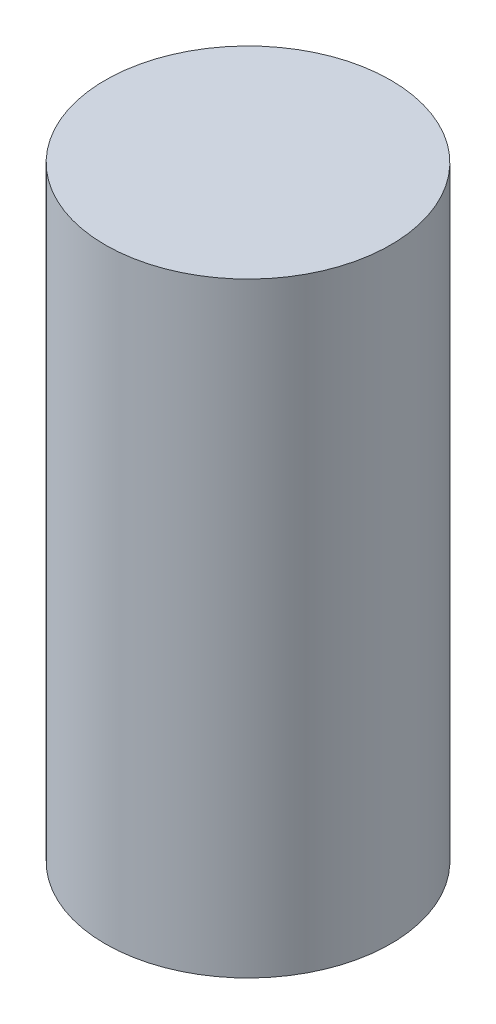
ISO-10303-21;
HEADER;
FILE_DESCRIPTION(('STEP AP214'),'2;1');
FILE_NAME('part.step','',(''),(''),'','','');
FILE_SCHEMA(('AUTOMOTIVE_DESIGN { 1 0 10303 214 1 1 1 1 }'));
ENDSEC;
DATA;
#1=APPLICATION_CONTEXT('core data for automotive mechanical design processes');
#2=APPLICATION_PROTOCOL_DEFINITION('international standard','automotive_design',2000,#1);
#3=PRODUCT_CONTEXT('',#1,'mechanical');
#4=PRODUCT('Part','Part','',(#3));
#5=PRODUCT_RELATED_PRODUCT_CATEGORY('part','',(#4));
#6=PRODUCT_DEFINITION_FORMATION('','',#4);
#7=PRODUCT_DEFINITION_CONTEXT('part definition',#1,'design');
#8=PRODUCT_DEFINITION('design','',#6,#7);
#9=PRODUCT_DEFINITION_SHAPE('','',#8);
#10=(LENGTH_UNIT() NAMED_UNIT(*) SI_UNIT(.MILLI.,.METRE.));
#11=(NAMED_UNIT(*) PLANE_ANGLE_UNIT() SI_UNIT($,.RADIAN.));
#12=(NAMED_UNIT(*) SI_UNIT($,.STERADIAN.) SOLID_ANGLE_UNIT());
#13=UNCERTAINTY_MEASURE_WITH_UNIT(LENGTH_MEASURE(1.E-05),#10,'distance_accuracy_value','');
#14=(GEOMETRIC_REPRESENTATION_CONTEXT(3) GLOBAL_UNCERTAINTY_ASSIGNED_CONTEXT((#13)) GLOBAL_UNIT_ASSIGNED_CONTEXT((#10,
#11,#12)) REPRESENTATION_CONTEXT('',''));
#15=CARTESIAN_POINT('',(0.,0.,0.));
#16=DIRECTION('',(0.,0.,1.));
#17=DIRECTION('',(1.,0.,0.));
#18=AXIS2_PLACEMENT_3D('',#15,#16,#17);
#19=CARTESIAN_POINT('',(0.,134.62,0.));
#20=DIRECTION('',(0.,-1.,0.));
#21=DIRECTION('',(0.,0.,-1.));
#22=AXIS2_PLACEMENT_3D('',#19,#20,#21);
#23=CYLINDRICAL_SURFACE('',#22,31.75);
#24=CARTESIAN_POINT('',(0.,134.62,0.));
#25=DIRECTION('',(0.,1.,0.));
#26=DIRECTION('',(0.,0.,1.));
#27=AXIS2_PLACEMENT_3D('',#24,#25,#26);
#28=CIRCLE('',#27,31.75);
#29=CARTESIAN_POINT('',(0.,134.62,31.75));
#30=VERTEX_POINT('',#29);
#31=EDGE_CURVE('E10',#30,#30,#28,.T.);
#32=ORIENTED_EDGE('',*,*,#31,.F.);
#33=EDGE_LOOP('',(#32));
#34=FACE_BOUND('',#33,.T.);
#35=CARTESIAN_POINT('',(0.,0.,0.));
#36=DIRECTION('',(0.,1.,0.));
#37=DIRECTION('',(0.,0.,1.));
#38=AXIS2_PLACEMENT_3D('',#35,#36,#37);
#39=CIRCLE('',#38,31.75);
#40=CARTESIAN_POINT('',(0.,0.,31.75));
#41=VERTEX_POINT('',#40);
#42=EDGE_CURVE('E34',#41,#41,#39,.T.);
#43=ORIENTED_EDGE('',*,*,#42,.T.);
#44=EDGE_LOOP('',(#43));
#45=FACE_BOUND('',#44,.T.);
#46=ADVANCED_FACE('F31',(#34,#45),#23,.T.);
#47=CARTESIAN_POINT('',(0.,134.62,0.));
#48=DIRECTION('',(0.,1.,0.));
#49=DIRECTION('',(0.,0.,1.));
#50=AXIS2_PLACEMENT_3D('',#47,#48,#49);
#51=PLANE('',#50);
#52=ORIENTED_EDGE('',*,*,#31,.T.);
#53=EDGE_LOOP('',(#52));
#54=FACE_BOUND('',#53,.T.);
#55=ADVANCED_FACE('F46',(#54),#51,.T.);
#56=CARTESIAN_POINT('',(0.,0.,0.));
#57=DIRECTION('',(0.,1.,0.));
#58=DIRECTION('',(0.,0.,1.));
#59=AXIS2_PLACEMENT_3D('',#56,#57,#58);
#60=PLANE('',#59);
#61=ORIENTED_EDGE('',*,*,#42,.F.);
#62=EDGE_LOOP('',(#61));
#63=FACE_BOUND('',#62,.T.);
#64=ADVANCED_FACE('F44',(#63),#60,.F.);
#65=CLOSED_SHELL('',(#46,#55,#64));
#66=MANIFOLD_SOLID_BREP('B2',#65);
#67=ADVANCED_BREP_SHAPE_REPRESENTATION('',(#18,#66),#14);
#68=SHAPE_DEFINITION_REPRESENTATION(#9,#67);
ENDSEC;
END-ISO-10303-21;
